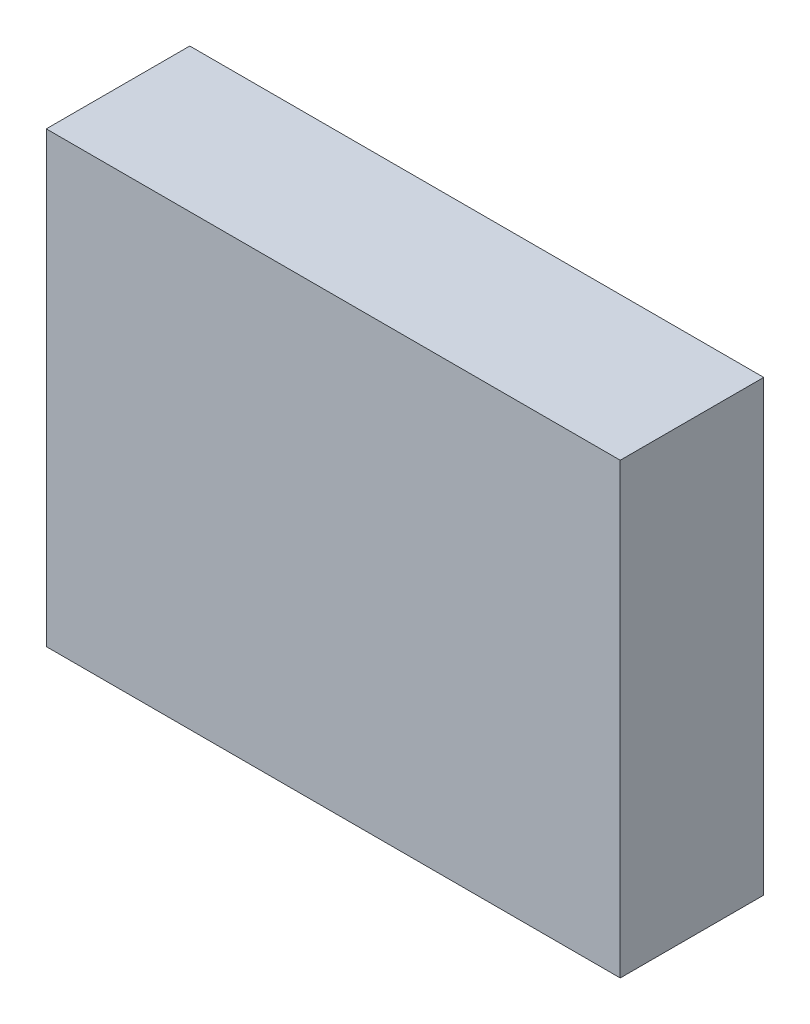
ISO-10303-21;
HEADER;
FILE_DESCRIPTION(('STEP AP214'),'2;1');
FILE_NAME('part.step','',(''),(''),'','','');
FILE_SCHEMA(('AUTOMOTIVE_DESIGN { 1 0 10303 214 1 1 1 1 }'));
ENDSEC;
DATA;
#1=APPLICATION_CONTEXT('core data for automotive mechanical design processes');
#2=APPLICATION_PROTOCOL_DEFINITION('international standard','automotive_design',2000,#1);
#3=PRODUCT_CONTEXT('',#1,'mechanical');
#4=PRODUCT('Part','Part','',(#3));
#5=PRODUCT_RELATED_PRODUCT_CATEGORY('part','',(#4));
#6=PRODUCT_DEFINITION_FORMATION('','',#4);
#7=PRODUCT_DEFINITION_CONTEXT('part definition',#1,'design');
#8=PRODUCT_DEFINITION('design','',#6,#7);
#9=PRODUCT_DEFINITION_SHAPE('','',#8);
#10=(LENGTH_UNIT() NAMED_UNIT(*) SI_UNIT(.MILLI.,.METRE.));
#11=(NAMED_UNIT(*) PLANE_ANGLE_UNIT() SI_UNIT($,.RADIAN.));
#12=(NAMED_UNIT(*) SI_UNIT($,.STERADIAN.) SOLID_ANGLE_UNIT());
#13=UNCERTAINTY_MEASURE_WITH_UNIT(LENGTH_MEASURE(1.E-05),#10,'distance_accuracy_value','');
#14=(GEOMETRIC_REPRESENTATION_CONTEXT(3) GLOBAL_UNCERTAINTY_ASSIGNED_CONTEXT((#13)) GLOBAL_UNIT_ASSIGNED_CONTEXT((#10,
#11,#12)) REPRESENTATION_CONTEXT('',''));
#15=CARTESIAN_POINT('',(0.,0.,0.));
#16=DIRECTION('',(0.,0.,1.));
#17=DIRECTION('',(1.,0.,0.));
#18=AXIS2_PLACEMENT_3D('',#15,#16,#17);
#19=CARTESIAN_POINT('',(-1.59999934,-1.25000004,0.80000094));
#20=DIRECTION('',(0.,0.,-1.));
#21=DIRECTION('',(-1.,0.,0.));
#22=AXIS2_PLACEMENT_3D('',#19,#20,#21);
#23=PLANE('',#22);
#24=DIRECTION('',(0.,1.,0.));
#25=VECTOR('',#24,1.);
#26=CARTESIAN_POINT('',(1.59999934,-1.25000004,0.80000094));
#27=LINE('',#26,#25);
#28=CARTESIAN_POINT('',(1.59999934,-1.25000004,0.80000094));
#29=VERTEX_POINT('',#28);
#30=CARTESIAN_POINT('',(1.59999934,1.25000004,0.80000094));
#31=VERTEX_POINT('',#30);
#32=EDGE_CURVE('E55',#29,#31,#27,.T.);
#33=ORIENTED_EDGE('',*,*,#32,.T.);
#34=DIRECTION('',(1.,0.,0.));
#35=VECTOR('',#34,1.);
#36=CARTESIAN_POINT('',(1.59999934,1.25000004,0.80000094));
#37=LINE('',#36,#35);
#38=CARTESIAN_POINT('',(-1.59999934,1.25000004,0.80000094));
#39=VERTEX_POINT('',#38);
#40=EDGE_CURVE('E57',#31,#39,#37,.F.);
#41=ORIENTED_EDGE('',*,*,#40,.T.);
#42=DIRECTION('',(0.,1.,0.));
#43=VECTOR('',#42,1.);
#44=CARTESIAN_POINT('',(-1.59999934,1.25000004,0.80000094));
#45=LINE('',#44,#43);
#46=CARTESIAN_POINT('',(-1.59999934,-1.25000004,0.80000094));
#47=VERTEX_POINT('',#46);
#48=EDGE_CURVE('E20',#39,#47,#45,.F.);
#49=ORIENTED_EDGE('',*,*,#48,.T.);
#50=DIRECTION('',(1.,0.,0.));
#51=VECTOR('',#50,1.);
#52=CARTESIAN_POINT('',(-1.59999934,-1.25000004,0.80000094));
#53=LINE('',#52,#51);
#54=EDGE_CURVE('E80',#47,#29,#53,.T.);
#55=ORIENTED_EDGE('',*,*,#54,.T.);
#56=EDGE_LOOP('',(#33,#41,#49,#55));
#57=FACE_BOUND('',#56,.T.);
#58=ADVANCED_FACE('F17',(#57),#23,.F.);
#59=CARTESIAN_POINT('',(-1.59999934,1.25000004,0.));
#60=DIRECTION('',(1.,0.,0.));
#61=DIRECTION('',(0.,0.,-1.));
#62=AXIS2_PLACEMENT_3D('',#59,#60,#61);
#63=PLANE('',#62);
#64=DIRECTION('',(0.,0.,1.));
#65=VECTOR('',#64,1.);
#66=CARTESIAN_POINT('',(-1.59999934,-1.25000004,0.));
#67=LINE('',#66,#65);
#68=CARTESIAN_POINT('',(-1.59999934,-1.25000004,0.));
#69=VERTEX_POINT('',#68);
#70=EDGE_CURVE('E68',#69,#47,#67,.T.);
#71=ORIENTED_EDGE('',*,*,#70,.T.);
#72=ORIENTED_EDGE('',*,*,#48,.F.);
#73=DIRECTION('',(0.,0.,-1.));
#74=VECTOR('',#73,1.);
#75=CARTESIAN_POINT('',(-1.59999934,1.25000004,0.));
#76=LINE('',#75,#74);
#77=CARTESIAN_POINT('',(-1.59999934,1.25000004,0.));
#78=VERTEX_POINT('',#77);
#79=EDGE_CURVE('E63',#39,#78,#76,.T.);
#80=ORIENTED_EDGE('',*,*,#79,.T.);
#81=DIRECTION('',(0.,1.,0.));
#82=VECTOR('',#81,1.);
#83=CARTESIAN_POINT('',(-1.59999934,-1.25000004,0.));
#84=LINE('',#83,#82);
#85=EDGE_CURVE('E83',#69,#78,#84,.T.);
#86=ORIENTED_EDGE('',*,*,#85,.F.);
#87=EDGE_LOOP('',(#71,#72,#80,#86));
#88=FACE_BOUND('',#87,.T.);
#89=ADVANCED_FACE('F65',(#88),#63,.F.);
#90=CARTESIAN_POINT('',(1.59999934,1.25000004,0.));
#91=DIRECTION('',(0.,-1.,0.));
#92=DIRECTION('',(0.,0.,-1.));
#93=AXIS2_PLACEMENT_3D('',#90,#91,#92);
#94=PLANE('',#93);
#95=ORIENTED_EDGE('',*,*,#79,.F.);
#96=ORIENTED_EDGE('',*,*,#40,.F.);
#97=DIRECTION('',(0.,0.,1.));
#98=VECTOR('',#97,1.);
#99=CARTESIAN_POINT('',(1.59999934,1.25000004,0.));
#100=LINE('',#99,#98);
#101=CARTESIAN_POINT('',(1.59999934,1.25000004,0.));
#102=VERTEX_POINT('',#101);
#103=EDGE_CURVE('E75',#31,#102,#100,.F.);
#104=ORIENTED_EDGE('',*,*,#103,.T.);
#105=DIRECTION('',(-1.,0.,0.));
#106=VECTOR('',#105,1.);
#107=CARTESIAN_POINT('',(-1.59999934,1.25000004,0.));
#108=LINE('',#107,#106);
#109=EDGE_CURVE('E72',#78,#102,#108,.F.);
#110=ORIENTED_EDGE('',*,*,#109,.F.);
#111=EDGE_LOOP('',(#95,#96,#104,#110));
#112=FACE_BOUND('',#111,.T.);
#113=ADVANCED_FACE('F70',(#112),#94,.F.);
#114=CARTESIAN_POINT('',(1.59999934,-1.25000004,0.));
#115=DIRECTION('',(-1.,0.,0.));
#116=DIRECTION('',(0.,0.,1.));
#117=AXIS2_PLACEMENT_3D('',#114,#115,#116);
#118=PLANE('',#117);
#119=ORIENTED_EDGE('',*,*,#103,.F.);
#120=ORIENTED_EDGE('',*,*,#32,.F.);
#121=DIRECTION('',(0.,0.,1.));
#122=VECTOR('',#121,1.);
#123=CARTESIAN_POINT('',(1.59999934,-1.25000004,0.));
#124=LINE('',#123,#122);
#125=CARTESIAN_POINT('',(1.59999934,-1.25000004,0.));
#126=VERTEX_POINT('',#125);
#127=EDGE_CURVE('E35',#29,#126,#124,.F.);
#128=ORIENTED_EDGE('',*,*,#127,.T.);
#129=DIRECTION('',(0.,1.,0.));
#130=VECTOR('',#129,1.);
#131=CARTESIAN_POINT('',(1.59999934,-1.25000004,0.));
#132=LINE('',#131,#130);
#133=EDGE_CURVE('E26',#102,#126,#132,.F.);
#134=ORIENTED_EDGE('',*,*,#133,.F.);
#135=EDGE_LOOP('',(#119,#120,#128,#134));
#136=FACE_BOUND('',#135,.T.);
#137=ADVANCED_FACE('F89',(#136),#118,.F.);
#138=CARTESIAN_POINT('',(-1.59999934,-1.25000004,0.));
#139=DIRECTION('',(0.,1.,0.));
#140=DIRECTION('',(0.,0.,1.));
#141=AXIS2_PLACEMENT_3D('',#138,#139,#140);
#142=PLANE('',#141);
#143=ORIENTED_EDGE('',*,*,#127,.F.);
#144=ORIENTED_EDGE('',*,*,#54,.F.);
#145=ORIENTED_EDGE('',*,*,#70,.F.);
#146=DIRECTION('',(-1.,0.,0.));
#147=VECTOR('',#146,1.);
#148=CARTESIAN_POINT('',(-1.59999934,-1.25000004,0.));
#149=LINE('',#148,#147);
#150=EDGE_CURVE('E11',#126,#69,#149,.T.);
#151=ORIENTED_EDGE('',*,*,#150,.F.);
#152=EDGE_LOOP('',(#143,#144,#145,#151));
#153=FACE_BOUND('',#152,.T.);
#154=ADVANCED_FACE('F91',(#153),#142,.F.);
#155=CARTESIAN_POINT('',(-1.59999934,-1.25000004,0.));
#156=DIRECTION('',(0.,0.,-1.));
#157=DIRECTION('',(-1.,0.,0.));
#158=AXIS2_PLACEMENT_3D('',#155,#156,#157);
#159=PLANE('',#158);
#160=ORIENTED_EDGE('',*,*,#133,.T.);
#161=ORIENTED_EDGE('',*,*,#150,.T.);
#162=ORIENTED_EDGE('',*,*,#85,.T.);
#163=ORIENTED_EDGE('',*,*,#109,.T.);
#164=EDGE_LOOP('',(#160,#161,#162,#163));
#165=FACE_BOUND('',#164,.T.);
#166=ADVANCED_FACE('F88',(#165),#159,.T.);
#167=CLOSED_SHELL('',(#58,#89,#113,#137,#154,#166));
#168=MANIFOLD_SOLID_BREP('B1',#167);
#169=ADVANCED_BREP_SHAPE_REPRESENTATION('',(#18,#168),#14);
#170=SHAPE_DEFINITION_REPRESENTATION(#9,#169);
ENDSEC;
END-ISO-10303-21;
